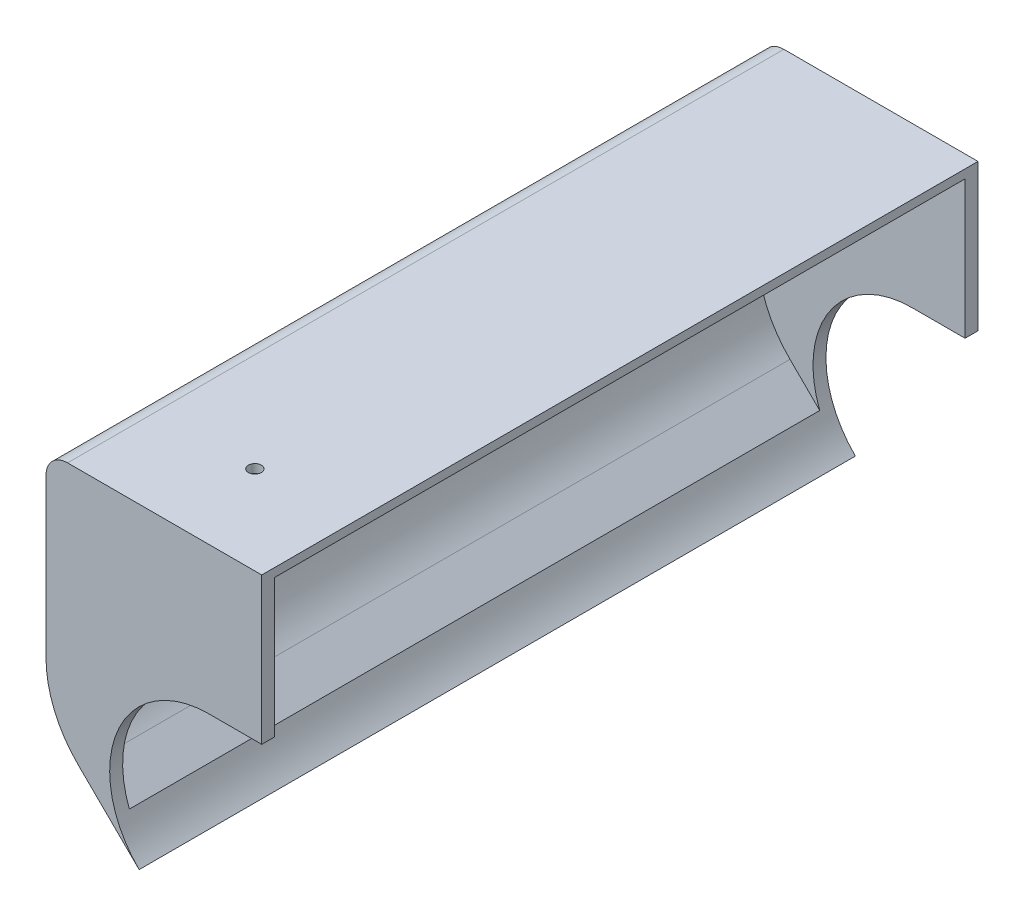
ISO-10303-21;
HEADER;
FILE_DESCRIPTION(('STEP AP214'),'2;1');
FILE_NAME('part.step','',(''),(''),'','','');
FILE_SCHEMA(('AUTOMOTIVE_DESIGN { 1 0 10303 214 1 1 1 1 }'));
ENDSEC;
DATA;
#1=APPLICATION_CONTEXT('core data for automotive mechanical design processes');
#2=APPLICATION_PROTOCOL_DEFINITION('international standard','automotive_design',2000,#1);
#3=PRODUCT_CONTEXT('',#1,'mechanical');
#4=PRODUCT('Part','Part','',(#3));
#5=PRODUCT_RELATED_PRODUCT_CATEGORY('part','',(#4));
#6=PRODUCT_DEFINITION_FORMATION('','',#4);
#7=PRODUCT_DEFINITION_CONTEXT('part definition',#1,'design');
#8=PRODUCT_DEFINITION('design','',#6,#7);
#9=PRODUCT_DEFINITION_SHAPE('','',#8);
#10=(LENGTH_UNIT() NAMED_UNIT(*) SI_UNIT(.MILLI.,.METRE.));
#11=(NAMED_UNIT(*) PLANE_ANGLE_UNIT() SI_UNIT($,.RADIAN.));
#12=(NAMED_UNIT(*) SI_UNIT($,.STERADIAN.) SOLID_ANGLE_UNIT());
#13=UNCERTAINTY_MEASURE_WITH_UNIT(LENGTH_MEASURE(1.E-05),#10,'distance_accuracy_value','');
#14=(GEOMETRIC_REPRESENTATION_CONTEXT(3) GLOBAL_UNCERTAINTY_ASSIGNED_CONTEXT((#13)) GLOBAL_UNIT_ASSIGNED_CONTEXT((#10,
#11,#12)) REPRESENTATION_CONTEXT('',''));
#15=CARTESIAN_POINT('',(0.,0.,0.));
#16=DIRECTION('',(0.,0.,1.));
#17=DIRECTION('',(1.,0.,0.));
#18=AXIS2_PLACEMENT_3D('',#15,#16,#17);
#19=CARTESIAN_POINT('',(-196.007283518404,25.8267663755461,-251.773732265294));
#20=DIRECTION('',(-1.,0.,0.));
#21=DIRECTION('',(0.,0.,1.));
#22=AXIS2_PLACEMENT_3D('',#19,#20,#21);
#23=PLANE('',#22);
#24=CARTESIAN_POINT('',(-196.007283518404,60.4000000000002,-20.5000000000001));
#25=DIRECTION('',(1.,0.,0.));
#26=DIRECTION('',(0.,0.,-1.));
#27=AXIS2_PLACEMENT_3D('',#24,#25,#26);
#28=CIRCLE('',#27,6.);
#29=CARTESIAN_POINT('',(-196.007283518404,60.4000000000002,-26.5000000000001));
#30=VERTEX_POINT('',#29);
#31=EDGE_CURVE('E487',#30,#30,#28,.T.);
#32=ORIENTED_EDGE('',*,*,#31,.F.);
#33=EDGE_LOOP('',(#32));
#34=FACE_BOUND('',#33,.T.);
#35=DIRECTION('',(0.,-1.,0.));
#36=VECTOR('',#35,1.);
#37=CARTESIAN_POINT('',(-196.007283518404,25.8267663755461,-3.));
#38=LINE('',#37,#36);
#39=CARTESIAN_POINT('',(-196.007283518404,70.,-3.));
#40=VERTEX_POINT('',#39);
#41=CARTESIAN_POINT('',(-196.007283518404,36.2637516572309,-3.));
#42=VERTEX_POINT('',#41);
#43=EDGE_CURVE('E243',#40,#42,#38,.T.);
#44=ORIENTED_EDGE('',*,*,#43,.T.);
#45=DIRECTION('',(0.,0.,1.));
#46=VECTOR('',#45,1.);
#47=CARTESIAN_POINT('',(-196.007283518404,36.2637516572309,-162.999999999996));
#48=LINE('',#47,#46);
#49=CARTESIAN_POINT('',(-196.007283518404,36.2637516572309,-162.999999999996));
#50=VERTEX_POINT('',#49);
#51=EDGE_CURVE('E319',#42,#50,#48,.F.);
#52=ORIENTED_EDGE('',*,*,#51,.T.);
#53=DIRECTION('',(0.,-1.,0.));
#54=VECTOR('',#53,1.);
#55=CARTESIAN_POINT('',(-196.007283518404,25.8267663755461,-162.999999999996));
#56=LINE('',#55,#54);
#57=CARTESIAN_POINT('',(-196.007283518404,70.,-162.999999999996));
#58=VERTEX_POINT('',#57);
#59=EDGE_CURVE('E252',#58,#50,#56,.T.);
#60=ORIENTED_EDGE('',*,*,#59,.F.);
#61=DIRECTION('',(0.,0.,1.));
#62=VECTOR('',#61,1.);
#63=CARTESIAN_POINT('',(-196.007283518404,70.,-3.));
#64=LINE('',#63,#62);
#65=EDGE_CURVE('E305',#58,#40,#64,.T.);
#66=ORIENTED_EDGE('',*,*,#65,.T.);
#67=EDGE_LOOP('',(#44,#52,#60,#66));
#68=FACE_BOUND('',#67,.T.);
#69=CARTESIAN_POINT('',(-196.007283518404,47.,-135.999999999996));
#70=DIRECTION('',(-1.,0.,0.));
#71=DIRECTION('',(0.,0.,1.));
#72=AXIS2_PLACEMENT_3D('',#69,#70,#71);
#73=CIRCLE('',#72,2.5);
#74=CARTESIAN_POINT('',(-196.007283518404,47.,-133.499999999996));
#75=VERTEX_POINT('',#74);
#76=EDGE_CURVE('E204',#75,#75,#73,.T.);
#77=ORIENTED_EDGE('',*,*,#76,.T.);
#78=EDGE_LOOP('',(#77));
#79=FACE_BOUND('',#78,.T.);
#80=CARTESIAN_POINT('',(-196.007283518404,47.,-30.));
#81=DIRECTION('',(-1.,0.,0.));
#82=DIRECTION('',(0.,0.,1.));
#83=AXIS2_PLACEMENT_3D('',#80,#81,#82);
#84=CIRCLE('',#83,2.5);
#85=CARTESIAN_POINT('',(-196.007283518404,47.,-27.5));
#86=VERTEX_POINT('',#85);
#87=EDGE_CURVE('E224',#86,#86,#84,.T.);
#88=ORIENTED_EDGE('',*,*,#87,.T.);
#89=EDGE_LOOP('',(#88));
#90=FACE_BOUND('',#89,.T.);
#91=DIRECTION('',(0.,1.,0.));
#92=VECTOR('',#91,1.);
#93=CARTESIAN_POINT('',(-196.007283518404,47.0000000000013,-105.499999999998));
#94=LINE('',#93,#92);
#95=CARTESIAN_POINT('',(-196.007283518404,47.0000000000013,-105.499999999998));
#96=VERTEX_POINT('',#95);
#97=CARTESIAN_POINT('',(-196.007283518404,67.0000000000014,-105.499999999998));
#98=VERTEX_POINT('',#97);
#99=EDGE_CURVE('E191',#96,#98,#94,.T.);
#100=ORIENTED_EDGE('',*,*,#99,.F.);
#101=DIRECTION('',(0.,0.,-1.));
#102=VECTOR('',#101,1.);
#103=CARTESIAN_POINT('',(-196.007283518404,47.0000000000009,-60.499999999998));
#104=LINE('',#103,#102);
#105=CARTESIAN_POINT('',(-196.007283518404,47.0000000000009,-60.499999999998));
#106=VERTEX_POINT('',#105);
#107=EDGE_CURVE('E188',#106,#96,#104,.T.);
#108=ORIENTED_EDGE('',*,*,#107,.F.);
#109=DIRECTION('',(0.,-1.,0.));
#110=VECTOR('',#109,1.);
#111=CARTESIAN_POINT('',(-196.007283518404,67.0000000000009,-60.4999999999978));
#112=LINE('',#111,#110);
#113=CARTESIAN_POINT('',(-196.007283518404,67.0000000000009,-60.4999999999978));
#114=VERTEX_POINT('',#113);
#115=EDGE_CURVE('E54',#114,#106,#112,.T.);
#116=ORIENTED_EDGE('',*,*,#115,.F.);
#117=DIRECTION('',(0.,0.,1.));
#118=VECTOR('',#117,1.);
#119=CARTESIAN_POINT('',(-196.007283518404,67.0000000000014,-105.499999999998));
#120=LINE('',#119,#118);
#121=EDGE_CURVE('E49',#98,#114,#120,.T.);
#122=ORIENTED_EDGE('',*,*,#121,.F.);
#123=EDGE_LOOP('',(#100,#108,#116,#122));
#124=FACE_BOUND('',#123,.T.);
#125=ADVANCED_FACE('F32',(#34,#68,#79,#90,#124),#23,.F.);
#126=CARTESIAN_POINT('',(-160.249999999999,20.,-3.));
#127=DIRECTION('',(0.,0.,1.));
#128=DIRECTION('',(1.,0.,0.));
#129=AXIS2_PLACEMENT_3D('',#126,#127,#128);
#130=PLANE('',#129);
#131=DIRECTION('',(0.711033468510001,-0.703158166175035,0.));
#132=VECTOR('',#131,1.);
#133=CARTESIAN_POINT('',(-181.686406662597,11.6645054498416,-3.));
#134=LINE('',#133,#132);
#135=CARTESIAN_POINT('',(-188.58623767278,18.4879149444809,-3.));
#136=VERTEX_POINT('',#135);
#137=CARTESIAN_POINT('',(-181.686406662598,11.6645054498418,-3.));
#138=VERTEX_POINT('',#137);
#139=EDGE_CURVE('E240',#136,#138,#134,.T.);
#140=ORIENTED_EDGE('',*,*,#139,.F.);
#141=CARTESIAN_POINT('',(-171.007283518404,36.2637516572309,-3.));
#142=DIRECTION('',(0.,0.,1.));
#143=DIRECTION('',(1.,0.,0.));
#144=AXIS2_PLACEMENT_3D('',#141,#142,#143);
#145=CIRCLE('',#144,25.);
#146=EDGE_CURVE('E317',#136,#42,#145,.F.);
#147=ORIENTED_EDGE('',*,*,#146,.T.);
#148=ORIENTED_EDGE('',*,*,#43,.F.);
#149=CARTESIAN_POINT('',(-191.007283518404,70.,-3.));
#150=DIRECTION('',(0.,0.,1.));
#151=DIRECTION('',(1.,0.,0.));
#152=AXIS2_PLACEMENT_3D('',#149,#150,#151);
#153=CIRCLE('',#152,5.);
#154=CARTESIAN_POINT('',(-191.007283518404,75.,-3.));
#155=VERTEX_POINT('',#154);
#156=EDGE_CURVE('E308',#40,#155,#153,.F.);
#157=ORIENTED_EDGE('',*,*,#156,.T.);
#158=DIRECTION('',(-1.,0.,0.));
#159=VECTOR('',#158,1.);
#160=CARTESIAN_POINT('',(-196.007283518404,75.,-3.));
#161=LINE('',#160,#159);
#162=CARTESIAN_POINT('',(-148.007283518404,75.,-3.));
#163=VERTEX_POINT('',#162);
#164=EDGE_CURVE('E246',#163,#155,#161,.T.);
#165=ORIENTED_EDGE('',*,*,#164,.F.);
#166=DIRECTION('',(0.,1.,0.));
#167=VECTOR('',#166,1.);
#168=CARTESIAN_POINT('',(-148.007283518404,43.,-3.));
#169=LINE('',#168,#167);
#170=CARTESIAN_POINT('',(-148.007283518404,43.,-3.));
#171=VERTEX_POINT('',#170);
#172=EDGE_CURVE('E268',#171,#163,#169,.T.);
#173=ORIENTED_EDGE('',*,*,#172,.F.);
#174=DIRECTION('',(1.,0.,0.));
#175=VECTOR('',#174,1.);
#176=CARTESIAN_POINT('',(-160.249999999999,43.,-3.));
#177=LINE('',#176,#175);
#178=CARTESIAN_POINT('',(-160.249999999999,43.,-3.));
#179=VERTEX_POINT('',#178);
#180=EDGE_CURVE('E264',#179,#171,#177,.T.);
#181=ORIENTED_EDGE('',*,*,#180,.F.);
#182=CARTESIAN_POINT('',(-160.249999999999,20.,-3.));
#183=DIRECTION('',(0.,0.,-1.));
#184=DIRECTION('',(1.,0.,0.));
#185=AXIS2_PLACEMENT_3D('',#182,#183,#184);
#186=CIRCLE('',#185,23.);
#187=EDGE_CURVE('E262',#138,#179,#186,.T.);
#188=ORIENTED_EDGE('',*,*,#187,.F.);
#189=EDGE_LOOP('',(#140,#147,#148,#157,#165,#173,#181,#188));
#190=FACE_BOUND('',#189,.T.);
#191=ADVANCED_FACE('F350',(#190),#130,.F.);
#192=CARTESIAN_POINT('',(-198.007283518404,24.9918075530113,-3.));
#193=DIRECTION('',(-1.,0.,0.));
#194=DIRECTION('',(0.,0.,1.));
#195=AXIS2_PLACEMENT_3D('',#192,#193,#194);
#196=PLANE('',#195);
#197=CARTESIAN_POINT('',(-198.007283518404,60.4000000000002,-20.5000000000001));
#198=DIRECTION('',(-1.,0.,0.));
#199=DIRECTION('',(0.,0.,1.));
#200=AXIS2_PLACEMENT_3D('',#197,#198,#199);
#201=CIRCLE('',#200,6.);
#202=CARTESIAN_POINT('',(-198.007283518404,60.4000000000002,-14.5000000000001));
#203=VERTEX_POINT('',#202);
#204=EDGE_CURVE('E482',#203,#203,#201,.F.);
#205=ORIENTED_EDGE('',*,*,#204,.T.);
#206=EDGE_LOOP('',(#205));
#207=FACE_BOUND('',#206,.T.);
#208=CARTESIAN_POINT('',(-198.007283518404,47.,-30.));
#209=DIRECTION('',(-1.,0.,0.));
#210=DIRECTION('',(0.,0.,1.));
#211=AXIS2_PLACEMENT_3D('',#208,#209,#210);
#212=CIRCLE('',#211,2.5);
#213=CARTESIAN_POINT('',(-198.007283518404,47.,-27.5));
#214=VERTEX_POINT('',#213);
#215=EDGE_CURVE('E201',#214,#214,#212,.T.);
#216=ORIENTED_EDGE('',*,*,#215,.F.);
#217=EDGE_LOOP('',(#216));
#218=FACE_BOUND('',#217,.T.);
#219=CARTESIAN_POINT('',(-198.007283518404,47.,-135.999999999996));
#220=DIRECTION('',(-1.,0.,0.));
#221=DIRECTION('',(0.,0.,-1.));
#222=AXIS2_PLACEMENT_3D('',#219,#220,#221);
#223=CIRCLE('',#222,2.5);
#224=CARTESIAN_POINT('',(-198.007283518404,47.,-138.499999999996));
#225=VERTEX_POINT('',#224);
#226=EDGE_CURVE('E205',#225,#225,#223,.T.);
#227=ORIENTED_EDGE('',*,*,#226,.F.);
#228=EDGE_LOOP('',(#227));
#229=FACE_BOUND('',#228,.T.);
#230=CARTESIAN_POINT('',(-198.007283518404,57.,-95.499999999998));
#231=DIRECTION('',(-1.,0.,0.));
#232=DIRECTION('',(0.,0.,1.));
#233=AXIS2_PLACEMENT_3D('',#230,#231,#232);
#234=CIRCLE('',#233,8.75);
#235=CARTESIAN_POINT('',(-198.007283518404,57.,-86.749999999998));
#236=VERTEX_POINT('',#235);
#237=EDGE_CURVE('E195',#236,#236,#234,.T.);
#238=ORIENTED_EDGE('',*,*,#237,.F.);
#239=EDGE_LOOP('',(#238));
#240=FACE_BOUND('',#239,.T.);
#241=CARTESIAN_POINT('',(-198.007283518404,57.,-70.499999999998));
#242=DIRECTION('',(-1.,0.,0.));
#243=DIRECTION('',(0.,0.,1.));
#244=AXIS2_PLACEMENT_3D('',#241,#242,#243);
#245=CIRCLE('',#244,8.75);
#246=CARTESIAN_POINT('',(-198.007283518404,57.,-61.749999999998));
#247=VERTEX_POINT('',#246);
#248=EDGE_CURVE('E192',#247,#247,#245,.T.);
#249=ORIENTED_EDGE('',*,*,#248,.F.);
#250=EDGE_LOOP('',(#249));
#251=FACE_BOUND('',#250,.T.);
#252=DIRECTION('',(0.,1.,0.));
#253=VECTOR('',#252,1.);
#254=CARTESIAN_POINT('',(-198.007283518404,24.9918075530113,-165.999999999996));
#255=LINE('',#254,#253);
#256=CARTESIAN_POINT('',(-198.007283518404,35.4287928346961,-165.999999999996));
#257=VERTEX_POINT('',#256);
#258=CARTESIAN_POINT('',(-198.007283518404,72.,-165.999999999996));
#259=VERTEX_POINT('',#258);
#260=EDGE_CURVE('E223',#257,#259,#255,.T.);
#261=ORIENTED_EDGE('',*,*,#260,.F.);
#262=DIRECTION('',(0.,0.,1.));
#263=VECTOR('',#262,1.);
#264=CARTESIAN_POINT('',(-198.007283518404,35.4287928346961,-3.));
#265=LINE('',#264,#263);
#266=CARTESIAN_POINT('',(-198.007283518404,35.4287928346961,0.));
#267=VERTEX_POINT('',#266);
#268=EDGE_CURVE('E323',#257,#267,#265,.T.);
#269=ORIENTED_EDGE('',*,*,#268,.T.);
#270=DIRECTION('',(0.,-1.,0.));
#271=VECTOR('',#270,1.);
#272=CARTESIAN_POINT('',(-198.007283518404,24.9918075530113,0.));
#273=LINE('',#272,#271);
#274=CARTESIAN_POINT('',(-198.007283518404,72.,0.));
#275=VERTEX_POINT('',#274);
#276=EDGE_CURVE('E251',#275,#267,#273,.T.);
#277=ORIENTED_EDGE('',*,*,#276,.F.);
#278=DIRECTION('',(0.,0.,1.));
#279=VECTOR('',#278,1.);
#280=CARTESIAN_POINT('',(-198.007283518404,72.,-3.));
#281=LINE('',#280,#279);
#282=EDGE_CURVE('E300',#275,#259,#281,.F.);
#283=ORIENTED_EDGE('',*,*,#282,.T.);
#284=EDGE_LOOP('',(#261,#269,#277,#283));
#285=FACE_BOUND('',#284,.T.);
#286=ADVANCED_FACE('F356',(#207,#218,#229,#240,#251,#285),#196,.T.);
#287=CARTESIAN_POINT('',(-198.007283518404,77.,-3.));
#288=DIRECTION('',(0.,1.,0.));
#289=DIRECTION('',(0.,0.,1.));
#290=AXIS2_PLACEMENT_3D('',#287,#288,#289);
#291=PLANE('',#290);
#292=CARTESIAN_POINT('',(-170.107283518404,77.,-20.5000000000002));
#293=DIRECTION('',(0.,1.,0.));
#294=DIRECTION('',(0.,0.,1.));
#295=AXIS2_PLACEMENT_3D('',#292,#293,#294);
#296=CIRCLE('',#295,1.5);
#297=CARTESIAN_POINT('',(-170.107283518404,77.,-19.0000000000002));
#298=VERTEX_POINT('',#297);
#299=EDGE_CURVE('E590',#298,#298,#296,.T.);
#300=ORIENTED_EDGE('',*,*,#299,.F.);
#301=EDGE_LOOP('',(#300));
#302=FACE_BOUND('',#301,.T.);
#303=DIRECTION('',(1.,0.,0.));
#304=VECTOR('',#303,1.);
#305=CARTESIAN_POINT('',(-198.007283518404,77.,-165.999999999996));
#306=LINE('',#305,#304);
#307=CARTESIAN_POINT('',(-193.007283518404,77.,-165.999999999996));
#308=VERTEX_POINT('',#307);
#309=CARTESIAN_POINT('',(-148.007283518404,77.,-165.999999999996));
#310=VERTEX_POINT('',#309);
#311=EDGE_CURVE('E226',#308,#310,#306,.T.);
#312=ORIENTED_EDGE('',*,*,#311,.F.);
#313=DIRECTION('',(0.,0.,1.));
#314=VECTOR('',#313,1.);
#315=CARTESIAN_POINT('',(-193.007283518404,77.,-3.));
#316=LINE('',#315,#314);
#317=CARTESIAN_POINT('',(-193.007283518404,77.,0.));
#318=VERTEX_POINT('',#317);
#319=EDGE_CURVE('E289',#308,#318,#316,.T.);
#320=ORIENTED_EDGE('',*,*,#319,.T.);
#321=DIRECTION('',(-1.,0.,0.));
#322=VECTOR('',#321,1.);
#323=CARTESIAN_POINT('',(-198.007283518404,77.,0.));
#324=LINE('',#323,#322);
#325=CARTESIAN_POINT('',(-148.007283518404,77.,0.));
#326=VERTEX_POINT('',#325);
#327=EDGE_CURVE('E265',#326,#318,#324,.T.);
#328=ORIENTED_EDGE('',*,*,#327,.F.);
#329=DIRECTION('',(0.,0.,1.));
#330=VECTOR('',#329,1.);
#331=CARTESIAN_POINT('',(-148.007283518404,77.,-3.));
#332=LINE('',#331,#330);
#333=EDGE_CURVE('E287',#310,#326,#332,.T.);
#334=ORIENTED_EDGE('',*,*,#333,.F.);
#335=EDGE_LOOP('',(#312,#320,#328,#334));
#336=FACE_BOUND('',#335,.T.);
#337=ADVANCED_FACE('F374',(#302,#336),#291,.T.);
#338=CARTESIAN_POINT('',(-148.007283518404,43.,-3.));
#339=DIRECTION('',(1.,0.,0.));
#340=DIRECTION('',(0.,0.,-1.));
#341=AXIS2_PLACEMENT_3D('',#338,#339,#340);
#342=PLANE('',#341);
#343=DIRECTION('',(0.,1.,0.));
#344=VECTOR('',#343,1.);
#345=CARTESIAN_POINT('',(-148.007283518404,43.,0.));
#346=LINE('',#345,#344);
#347=CARTESIAN_POINT('',(-148.007283518404,43.,0.));
#348=VERTEX_POINT('',#347);
#349=EDGE_CURVE('E282',#348,#326,#346,.T.);
#350=ORIENTED_EDGE('',*,*,#349,.F.);
#351=DIRECTION('',(0.,0.,1.));
#352=VECTOR('',#351,1.);
#353=CARTESIAN_POINT('',(-148.007283518404,43.,-3.));
#354=LINE('',#353,#352);
#355=EDGE_CURVE('E290',#171,#348,#354,.T.);
#356=ORIENTED_EDGE('',*,*,#355,.F.);
#357=ORIENTED_EDGE('',*,*,#172,.T.);
#358=DIRECTION('',(0.,0.,1.));
#359=VECTOR('',#358,1.);
#360=CARTESIAN_POINT('',(-148.007283518404,75.,-251.773732265294));
#361=LINE('',#360,#359);
#362=CARTESIAN_POINT('',(-148.007283518404,75.,-162.999999999996));
#363=VERTEX_POINT('',#362);
#364=EDGE_CURVE('E238',#363,#163,#361,.T.);
#365=ORIENTED_EDGE('',*,*,#364,.F.);
#366=DIRECTION('',(0.,-1.,0.));
#367=VECTOR('',#366,1.);
#368=CARTESIAN_POINT('',(-148.007283518404,77.,-162.999999999996));
#369=LINE('',#368,#367);
#370=CARTESIAN_POINT('',(-148.007283518404,43.,-162.999999999996));
#371=VERTEX_POINT('',#370);
#372=EDGE_CURVE('E210',#363,#371,#369,.T.);
#373=ORIENTED_EDGE('',*,*,#372,.T.);
#374=DIRECTION('',(0.,0.,-1.));
#375=VECTOR('',#374,1.);
#376=CARTESIAN_POINT('',(-148.007283518404,43.,-162.999999999996));
#377=LINE('',#376,#375);
#378=CARTESIAN_POINT('',(-148.007283518404,43.,-165.999999999996));
#379=VERTEX_POINT('',#378);
#380=EDGE_CURVE('E219',#371,#379,#377,.T.);
#381=ORIENTED_EDGE('',*,*,#380,.T.);
#382=DIRECTION('',(0.,-1.,0.));
#383=VECTOR('',#382,1.);
#384=CARTESIAN_POINT('',(-148.007283518404,77.,-165.999999999996));
#385=LINE('',#384,#383);
#386=EDGE_CURVE('E228',#310,#379,#385,.T.);
#387=ORIENTED_EDGE('',*,*,#386,.F.);
#388=ORIENTED_EDGE('',*,*,#333,.T.);
#389=EDGE_LOOP('',(#350,#356,#357,#365,#373,#381,#387,#388));
#390=FACE_BOUND('',#389,.T.);
#391=ADVANCED_FACE('F377',(#390),#342,.T.);
#392=CARTESIAN_POINT('',(-160.249999999999,43.,-3.));
#393=DIRECTION('',(0.,-1.,0.));
#394=DIRECTION('',(0.,0.,-1.));
#395=AXIS2_PLACEMENT_3D('',#392,#393,#394);
#396=PLANE('',#395);
#397=DIRECTION('',(1.,0.,0.));
#398=VECTOR('',#397,1.);
#399=CARTESIAN_POINT('',(-160.249999999999,43.,0.));
#400=LINE('',#399,#398);
#401=CARTESIAN_POINT('',(-160.249999999999,43.,0.));
#402=VERTEX_POINT('',#401);
#403=EDGE_CURVE('E279',#402,#348,#400,.T.);
#404=ORIENTED_EDGE('',*,*,#403,.F.);
#405=DIRECTION('',(0.,0.,1.));
#406=VECTOR('',#405,1.);
#407=CARTESIAN_POINT('',(-160.249999999999,43.,-3.));
#408=LINE('',#407,#406);
#409=EDGE_CURVE('E292',#179,#402,#408,.T.);
#410=ORIENTED_EDGE('',*,*,#409,.F.);
#411=ORIENTED_EDGE('',*,*,#180,.T.);
#412=ORIENTED_EDGE('',*,*,#355,.T.);
#413=EDGE_LOOP('',(#404,#410,#411,#412));
#414=FACE_BOUND('',#413,.T.);
#415=ADVANCED_FACE('F381',(#414),#396,.T.);
#416=CARTESIAN_POINT('',(-160.249999999999,20.,-3.));
#417=DIRECTION('',(0.,0.,1.));
#418=DIRECTION('',(1.,0.,0.));
#419=AXIS2_PLACEMENT_3D('',#416,#417,#418);
#420=CYLINDRICAL_SURFACE('',#419,23.);
#421=CARTESIAN_POINT('',(-160.249999999999,20.,0.));
#422=DIRECTION('',(0.,0.,-1.));
#423=DIRECTION('',(1.,0.,0.));
#424=AXIS2_PLACEMENT_3D('',#421,#422,#423);
#425=CIRCLE('',#424,23.);
#426=CARTESIAN_POINT('',(-176.422637822025,3.64623022426997,0.));
#427=VERTEX_POINT('',#426);
#428=EDGE_CURVE('E276',#427,#402,#425,.T.);
#429=ORIENTED_EDGE('',*,*,#428,.F.);
#430=DIRECTION('',(0.,0.,1.));
#431=VECTOR('',#430,1.);
#432=CARTESIAN_POINT('',(-176.422637822025,3.64623022426997,-3.));
#433=LINE('',#432,#431);
#434=CARTESIAN_POINT('',(-176.422637822025,3.64623022426997,-165.999999999996));
#435=VERTEX_POINT('',#434);
#436=EDGE_CURVE('E271',#435,#427,#433,.T.);
#437=ORIENTED_EDGE('',*,*,#436,.F.);
#438=CARTESIAN_POINT('',(-160.249999999999,20.,-165.999999999996));
#439=DIRECTION('',(0.,0.,1.));
#440=DIRECTION('',(-1.,0.,0.));
#441=AXIS2_PLACEMENT_3D('',#438,#439,#440);
#442=CIRCLE('',#441,23.);
#443=CARTESIAN_POINT('',(-160.249999999999,43.,-165.999999999996));
#444=VERTEX_POINT('',#443);
#445=EDGE_CURVE('E213',#444,#435,#442,.T.);
#446=ORIENTED_EDGE('',*,*,#445,.F.);
#447=DIRECTION('',(0.,0.,-1.));
#448=VECTOR('',#447,1.);
#449=CARTESIAN_POINT('',(-160.249999999999,43.,-162.999999999996));
#450=LINE('',#449,#448);
#451=CARTESIAN_POINT('',(-160.249999999999,43.,-162.999999999996));
#452=VERTEX_POINT('',#451);
#453=EDGE_CURVE('E236',#452,#444,#450,.T.);
#454=ORIENTED_EDGE('',*,*,#453,.F.);
#455=CARTESIAN_POINT('',(-160.249999999999,20.,-162.999999999996));
#456=DIRECTION('',(0.,0.,1.));
#457=DIRECTION('',(-1.,0.,0.));
#458=AXIS2_PLACEMENT_3D('',#455,#456,#457);
#459=CIRCLE('',#458,23.);
#460=CARTESIAN_POINT('',(-181.686406662598,11.6645054498418,-162.999999999996));
#461=VERTEX_POINT('',#460);
#462=EDGE_CURVE('E216',#452,#461,#459,.T.);
#463=ORIENTED_EDGE('',*,*,#462,.T.);
#464=DIRECTION('',(0.,0.,1.));
#465=VECTOR('',#464,1.);
#466=CARTESIAN_POINT('',(-181.686406662597,11.6645054498416,-251.773732265294));
#467=LINE('',#466,#465);
#468=EDGE_CURVE('E242',#461,#138,#467,.T.);
#469=ORIENTED_EDGE('',*,*,#468,.T.);
#470=ORIENTED_EDGE('',*,*,#187,.T.);
#471=ORIENTED_EDGE('',*,*,#409,.T.);
#472=EDGE_LOOP('',(#429,#437,#446,#454,#463,#469,#470,#471));
#473=FACE_BOUND('',#472,.T.);
#474=ADVANCED_FACE('F385',(#473),#420,.F.);
#475=CARTESIAN_POINT('',(-176.422637822025,3.64623022426997,-3.));
#476=DIRECTION('',(-0.703158166175034,-0.711033468510001,0.));
#477=DIRECTION('',(0.711033468510001,-0.703158166175034,0.));
#478=AXIS2_PLACEMENT_3D('',#475,#476,#477);
#479=PLANE('',#478);
#480=DIRECTION('',(0.711033468510001,-0.703158166175034,0.));
#481=VECTOR('',#480,1.);
#482=CARTESIAN_POINT('',(-176.422637822025,3.64623022426997,0.));
#483=LINE('',#482,#481);
#484=CARTESIAN_POINT('',(-190.58623767278,17.6529561219461,0.));
#485=VERTEX_POINT('',#484);
#486=EDGE_CURVE('E274',#485,#427,#483,.T.);
#487=ORIENTED_EDGE('',*,*,#486,.F.);
#488=DIRECTION('',(0.,0.,1.));
#489=VECTOR('',#488,1.);
#490=CARTESIAN_POINT('',(-190.58623767278,17.6529561219461,-3.));
#491=LINE('',#490,#489);
#492=CARTESIAN_POINT('',(-190.58623767278,17.6529561219461,-165.999999999996));
#493=VERTEX_POINT('',#492);
#494=EDGE_CURVE('E41',#485,#493,#491,.F.);
#495=ORIENTED_EDGE('',*,*,#494,.T.);
#496=DIRECTION('',(-0.711033468510001,0.703158166175035,0.));
#497=VECTOR('',#496,1.);
#498=CARTESIAN_POINT('',(-176.422637822025,3.64623022426997,-165.999999999996));
#499=LINE('',#498,#497);
#500=EDGE_CURVE('E220',#435,#493,#499,.T.);
#501=ORIENTED_EDGE('',*,*,#500,.F.);
#502=ORIENTED_EDGE('',*,*,#436,.T.);
#503=EDGE_LOOP('',(#487,#495,#501,#502));
#504=FACE_BOUND('',#503,.T.);
#505=ADVANCED_FACE('F372',(#504),#479,.T.);
#506=CARTESIAN_POINT('',(-160.249999999999,20.,0.));
#507=DIRECTION('',(0.,0.,1.));
#508=DIRECTION('',(1.,0.,0.));
#509=AXIS2_PLACEMENT_3D('',#506,#507,#508);
#510=PLANE('',#509);
#511=ORIENTED_EDGE('',*,*,#276,.T.);
#512=CARTESIAN_POINT('',(-173.007283518404,35.4287928346961,0.));
#513=DIRECTION('',(0.,0.,1.));
#514=DIRECTION('',(1.,0.,0.));
#515=AXIS2_PLACEMENT_3D('',#512,#513,#514);
#516=CIRCLE('',#515,25.);
#517=EDGE_CURVE('E326',#267,#485,#516,.T.);
#518=ORIENTED_EDGE('',*,*,#517,.T.);
#519=ORIENTED_EDGE('',*,*,#486,.T.);
#520=ORIENTED_EDGE('',*,*,#428,.T.);
#521=ORIENTED_EDGE('',*,*,#403,.T.);
#522=ORIENTED_EDGE('',*,*,#349,.T.);
#523=ORIENTED_EDGE('',*,*,#327,.T.);
#524=CARTESIAN_POINT('',(-193.007283518404,72.,0.));
#525=DIRECTION('',(0.,0.,1.));
#526=DIRECTION('',(1.,0.,0.));
#527=AXIS2_PLACEMENT_3D('',#524,#525,#526);
#528=CIRCLE('',#527,5.);
#529=EDGE_CURVE('E298',#318,#275,#528,.T.);
#530=ORIENTED_EDGE('',*,*,#529,.T.);
#531=EDGE_LOOP('',(#511,#518,#519,#520,#521,#522,#523,#530));
#532=FACE_BOUND('',#531,.T.);
#533=ADVANCED_FACE('F367',(#532),#510,.T.);
#534=CARTESIAN_POINT('',(-196.007283518404,75.,-251.773732265294));
#535=DIRECTION('',(0.,1.,0.));
#536=DIRECTION('',(0.,0.,1.));
#537=AXIS2_PLACEMENT_3D('',#534,#535,#536);
#538=PLANE('',#537);
#539=CARTESIAN_POINT('',(-170.107283518404,75.,-20.5000000000002));
#540=DIRECTION('',(0.,1.,0.));
#541=DIRECTION('',(0.,0.,1.));
#542=AXIS2_PLACEMENT_3D('',#539,#540,#541);
#543=CIRCLE('',#542,1.5);
#544=CARTESIAN_POINT('',(-170.107283518404,75.,-19.0000000000002));
#545=VERTEX_POINT('',#544);
#546=EDGE_CURVE('E36',#545,#545,#543,.T.);
#547=ORIENTED_EDGE('',*,*,#546,.T.);
#548=EDGE_LOOP('',(#547));
#549=FACE_BOUND('',#548,.T.);
#550=ORIENTED_EDGE('',*,*,#164,.T.);
#551=DIRECTION('',(0.,0.,1.));
#552=VECTOR('',#551,1.);
#553=CARTESIAN_POINT('',(-191.007283518404,75.,-162.999999999996));
#554=LINE('',#553,#552);
#555=CARTESIAN_POINT('',(-191.007283518404,75.,-162.999999999996));
#556=VERTEX_POINT('',#555);
#557=EDGE_CURVE('E310',#155,#556,#554,.F.);
#558=ORIENTED_EDGE('',*,*,#557,.T.);
#559=DIRECTION('',(-1.,0.,0.));
#560=VECTOR('',#559,1.);
#561=CARTESIAN_POINT('',(-196.007283518404,75.,-162.999999999996));
#562=LINE('',#561,#560);
#563=EDGE_CURVE('E255',#363,#556,#562,.T.);
#564=ORIENTED_EDGE('',*,*,#563,.F.);
#565=ORIENTED_EDGE('',*,*,#364,.T.);
#566=EDGE_LOOP('',(#550,#558,#564,#565));
#567=FACE_BOUND('',#566,.T.);
#568=ADVANCED_FACE('F365',(#549,#567),#538,.F.);
#569=CARTESIAN_POINT('',(-181.686406662597,11.6645054498416,-251.773732265294));
#570=DIRECTION('',(-0.703158166175035,-0.711033468510001,0.));
#571=DIRECTION('',(0.711033468510001,-0.703158166175035,0.));
#572=AXIS2_PLACEMENT_3D('',#569,#570,#571);
#573=PLANE('',#572);
#574=DIRECTION('',(0.711033468510001,-0.703158166175035,0.));
#575=VECTOR('',#574,1.);
#576=CARTESIAN_POINT('',(-181.686406662597,11.6645054498416,-162.999999999996));
#577=LINE('',#576,#575);
#578=CARTESIAN_POINT('',(-188.58623767278,18.4879149444809,-162.999999999996));
#579=VERTEX_POINT('',#578);
#580=EDGE_CURVE('E249',#579,#461,#577,.T.);
#581=ORIENTED_EDGE('',*,*,#580,.F.);
#582=DIRECTION('',(0.,0.,1.));
#583=VECTOR('',#582,1.);
#584=CARTESIAN_POINT('',(-188.58623767278,18.4879149444809,-3.));
#585=LINE('',#584,#583);
#586=EDGE_CURVE('E314',#579,#136,#585,.T.);
#587=ORIENTED_EDGE('',*,*,#586,.T.);
#588=ORIENTED_EDGE('',*,*,#139,.T.);
#589=ORIENTED_EDGE('',*,*,#468,.F.);
#590=EDGE_LOOP('',(#581,#587,#588,#589));
#591=FACE_BOUND('',#590,.T.);
#592=ADVANCED_FACE('F363',(#591),#573,.F.);
#593=CARTESIAN_POINT('',(-160.249999999999,20.,-162.999999999996));
#594=DIRECTION('',(0.,0.,-1.));
#595=DIRECTION('',(-1.,0.,0.));
#596=AXIS2_PLACEMENT_3D('',#593,#594,#595);
#597=PLANE('',#596);
#598=ORIENTED_EDGE('',*,*,#59,.T.);
#599=CARTESIAN_POINT('',(-171.007283518404,36.2637516572309,-162.999999999996));
#600=DIRECTION('',(0.,0.,-1.));
#601=DIRECTION('',(-1.,0.,0.));
#602=AXIS2_PLACEMENT_3D('',#599,#600,#601);
#603=CIRCLE('',#602,25.);
#604=EDGE_CURVE('E321',#50,#579,#603,.F.);
#605=ORIENTED_EDGE('',*,*,#604,.T.);
#606=ORIENTED_EDGE('',*,*,#580,.T.);
#607=ORIENTED_EDGE('',*,*,#462,.F.);
#608=DIRECTION('',(-1.,0.,0.));
#609=VECTOR('',#608,1.);
#610=CARTESIAN_POINT('',(-148.007283518404,43.,-162.999999999996));
#611=LINE('',#610,#609);
#612=EDGE_CURVE('E212',#371,#452,#611,.T.);
#613=ORIENTED_EDGE('',*,*,#612,.F.);
#614=ORIENTED_EDGE('',*,*,#372,.F.);
#615=ORIENTED_EDGE('',*,*,#563,.T.);
#616=CARTESIAN_POINT('',(-191.007283518404,70.,-162.999999999996));
#617=DIRECTION('',(0.,0.,-1.));
#618=DIRECTION('',(-1.,0.,0.));
#619=AXIS2_PLACEMENT_3D('',#616,#617,#618);
#620=CIRCLE('',#619,5.);
#621=EDGE_CURVE('E312',#556,#58,#620,.F.);
#622=ORIENTED_EDGE('',*,*,#621,.T.);
#623=EDGE_LOOP('',(#598,#605,#606,#607,#613,#614,#615,#622));
#624=FACE_BOUND('',#623,.T.);
#625=ADVANCED_FACE('F417',(#624),#597,.F.);
#626=CARTESIAN_POINT('',(-148.007283518404,43.,-162.999999999996));
#627=DIRECTION('',(0.,-1.,0.));
#628=DIRECTION('',(1.,0.,0.));
#629=AXIS2_PLACEMENT_3D('',#626,#627,#628);
#630=PLANE('',#629);
#631=DIRECTION('',(-1.,0.,0.));
#632=VECTOR('',#631,1.);
#633=CARTESIAN_POINT('',(-148.007283518404,43.,-165.999999999996));
#634=LINE('',#633,#632);
#635=EDGE_CURVE('E231',#379,#444,#634,.T.);
#636=ORIENTED_EDGE('',*,*,#635,.F.);
#637=ORIENTED_EDGE('',*,*,#380,.F.);
#638=ORIENTED_EDGE('',*,*,#612,.T.);
#639=ORIENTED_EDGE('',*,*,#453,.T.);
#640=EDGE_LOOP('',(#636,#637,#638,#639));
#641=FACE_BOUND('',#640,.T.);
#642=ADVANCED_FACE('F431',(#641),#630,.T.);
#643=CARTESIAN_POINT('',(-160.249999999999,20.,-165.999999999996));
#644=DIRECTION('',(0.,0.,-1.));
#645=DIRECTION('',(-1.,0.,0.));
#646=AXIS2_PLACEMENT_3D('',#643,#644,#645);
#647=PLANE('',#646);
#648=ORIENTED_EDGE('',*,*,#500,.T.);
#649=CARTESIAN_POINT('',(-173.007283518404,35.4287928346961,-165.999999999996));
#650=DIRECTION('',(0.,0.,-1.));
#651=DIRECTION('',(-1.,0.,0.));
#652=AXIS2_PLACEMENT_3D('',#649,#650,#651);
#653=CIRCLE('',#652,25.);
#654=EDGE_CURVE('E11',#493,#257,#653,.T.);
#655=ORIENTED_EDGE('',*,*,#654,.T.);
#656=ORIENTED_EDGE('',*,*,#260,.T.);
#657=CARTESIAN_POINT('',(-193.007283518404,72.,-165.999999999996));
#658=DIRECTION('',(0.,0.,-1.));
#659=DIRECTION('',(-1.,0.,0.));
#660=AXIS2_PLACEMENT_3D('',#657,#658,#659);
#661=CIRCLE('',#660,5.);
#662=EDGE_CURVE('E303',#259,#308,#661,.T.);
#663=ORIENTED_EDGE('',*,*,#662,.T.);
#664=ORIENTED_EDGE('',*,*,#311,.T.);
#665=ORIENTED_EDGE('',*,*,#386,.T.);
#666=ORIENTED_EDGE('',*,*,#635,.T.);
#667=ORIENTED_EDGE('',*,*,#445,.T.);
#668=EDGE_LOOP('',(#648,#655,#656,#663,#664,#665,#666,#667));
#669=FACE_BOUND('',#668,.T.);
#670=ADVANCED_FACE('F400',(#669),#647,.T.);
#671=CARTESIAN_POINT('',(-193.007283518404,72.,-3.));
#672=DIRECTION('',(0.,0.,1.));
#673=DIRECTION('',(1.,0.,0.));
#674=AXIS2_PLACEMENT_3D('',#671,#672,#673);
#675=CYLINDRICAL_SURFACE('',#674,5.);
#676=ORIENTED_EDGE('',*,*,#662,.F.);
#677=ORIENTED_EDGE('',*,*,#282,.F.);
#678=ORIENTED_EDGE('',*,*,#529,.F.);
#679=ORIENTED_EDGE('',*,*,#319,.F.);
#680=EDGE_LOOP('',(#676,#677,#678,#679));
#681=FACE_BOUND('',#680,.T.);
#682=ADVANCED_FACE('F396',(#681),#675,.T.);
#683=CARTESIAN_POINT('',(-191.007283518404,70.,-251.773732265294));
#684=DIRECTION('',(0.,0.,-1.));
#685=DIRECTION('',(-1.,0.,0.));
#686=AXIS2_PLACEMENT_3D('',#683,#684,#685);
#687=CYLINDRICAL_SURFACE('',#686,5.);
#688=ORIENTED_EDGE('',*,*,#621,.F.);
#689=ORIENTED_EDGE('',*,*,#557,.F.);
#690=ORIENTED_EDGE('',*,*,#156,.F.);
#691=ORIENTED_EDGE('',*,*,#65,.F.);
#692=EDGE_LOOP('',(#688,#689,#690,#691));
#693=FACE_BOUND('',#692,.T.);
#694=ADVANCED_FACE('F399',(#693),#687,.F.);
#695=CARTESIAN_POINT('',(-171.007283518404,36.2637516572309,-251.773732265294));
#696=DIRECTION('',(0.,0.,-1.));
#697=DIRECTION('',(-1.,0.,0.));
#698=AXIS2_PLACEMENT_3D('',#695,#696,#697);
#699=CYLINDRICAL_SURFACE('',#698,25.);
#700=ORIENTED_EDGE('',*,*,#604,.F.);
#701=ORIENTED_EDGE('',*,*,#51,.F.);
#702=ORIENTED_EDGE('',*,*,#146,.F.);
#703=ORIENTED_EDGE('',*,*,#586,.F.);
#704=EDGE_LOOP('',(#700,#701,#702,#703));
#705=FACE_BOUND('',#704,.T.);
#706=ADVANCED_FACE('F403',(#705),#699,.F.);
#707=CARTESIAN_POINT('',(-173.007283518404,35.4287928346961,-3.));
#708=DIRECTION('',(0.,0.,1.));
#709=DIRECTION('',(1.,0.,0.));
#710=AXIS2_PLACEMENT_3D('',#707,#708,#709);
#711=CYLINDRICAL_SURFACE('',#710,25.);
#712=ORIENTED_EDGE('',*,*,#654,.F.);
#713=ORIENTED_EDGE('',*,*,#494,.F.);
#714=ORIENTED_EDGE('',*,*,#517,.F.);
#715=ORIENTED_EDGE('',*,*,#268,.F.);
#716=EDGE_LOOP('',(#712,#713,#714,#715));
#717=FACE_BOUND('',#716,.T.);
#718=ADVANCED_FACE('F34',(#717),#711,.T.);
#719=CARTESIAN_POINT('',(-191.007283518404,57.,-70.499999999998));
#720=DIRECTION('',(-1.,0.,0.));
#721=DIRECTION('',(0.,0.,1.));
#722=AXIS2_PLACEMENT_3D('',#719,#720,#721);
#723=CYLINDRICAL_SURFACE('',#722,8.75);
#724=ORIENTED_EDGE('',*,*,#248,.T.);
#725=EDGE_LOOP('',(#724));
#726=FACE_BOUND('',#725,.T.);
#727=CARTESIAN_POINT('',(-188.007283518404,57.,-70.499999999998));
#728=DIRECTION('',(1.,0.,0.));
#729=DIRECTION('',(0.,0.,-1.));
#730=AXIS2_PLACEMENT_3D('',#727,#728,#729);
#731=CIRCLE('',#730,8.75);
#732=CARTESIAN_POINT('',(-188.007283518404,57.,-79.249999999998));
#733=VERTEX_POINT('',#732);
#734=EDGE_CURVE('E481',#733,#733,#731,.T.);
#735=ORIENTED_EDGE('',*,*,#734,.T.);
#736=EDGE_LOOP('',(#735));
#737=FACE_BOUND('',#736,.T.);
#738=ADVANCED_FACE('F410',(#726,#737),#723,.F.);
#739=CARTESIAN_POINT('',(-191.007283518404,57.,-95.499999999998));
#740=DIRECTION('',(-1.,0.,0.));
#741=DIRECTION('',(0.,0.,1.));
#742=AXIS2_PLACEMENT_3D('',#739,#740,#741);
#743=CYLINDRICAL_SURFACE('',#742,8.75);
#744=ORIENTED_EDGE('',*,*,#237,.T.);
#745=EDGE_LOOP('',(#744));
#746=FACE_BOUND('',#745,.T.);
#747=CARTESIAN_POINT('',(-188.007283518404,57.,-95.499999999998));
#748=DIRECTION('',(1.,0.,0.));
#749=DIRECTION('',(0.,0.,-1.));
#750=AXIS2_PLACEMENT_3D('',#747,#748,#749);
#751=CIRCLE('',#750,8.75);
#752=CARTESIAN_POINT('',(-188.007283518404,57.,-104.249999999998));
#753=VERTEX_POINT('',#752);
#754=EDGE_CURVE('E480',#753,#753,#751,.T.);
#755=ORIENTED_EDGE('',*,*,#754,.T.);
#756=EDGE_LOOP('',(#755));
#757=FACE_BOUND('',#756,.T.);
#758=ADVANCED_FACE('F345',(#746,#757),#743,.F.);
#759=CARTESIAN_POINT('',(-191.007283518404,47.,-135.999999999996));
#760=DIRECTION('',(-1.,0.,0.));
#761=DIRECTION('',(0.,0.,1.));
#762=AXIS2_PLACEMENT_3D('',#759,#760,#761);
#763=CYLINDRICAL_SURFACE('',#762,2.5);
#764=ORIENTED_EDGE('',*,*,#226,.T.);
#765=EDGE_LOOP('',(#764));
#766=FACE_BOUND('',#765,.T.);
#767=ORIENTED_EDGE('',*,*,#76,.F.);
#768=EDGE_LOOP('',(#767));
#769=FACE_BOUND('',#768,.T.);
#770=ADVANCED_FACE('F336',(#766,#769),#763,.F.);
#771=CARTESIAN_POINT('',(-191.007283518404,47.,-30.));
#772=DIRECTION('',(-1.,0.,0.));
#773=DIRECTION('',(0.,0.,1.));
#774=AXIS2_PLACEMENT_3D('',#771,#772,#773);
#775=CYLINDRICAL_SURFACE('',#774,2.5);
#776=ORIENTED_EDGE('',*,*,#215,.T.);
#777=EDGE_LOOP('',(#776));
#778=FACE_BOUND('',#777,.T.);
#779=ORIENTED_EDGE('',*,*,#87,.F.);
#780=EDGE_LOOP('',(#779));
#781=FACE_BOUND('',#780,.T.);
#782=ADVANCED_FACE('F334',(#778,#781),#775,.F.);
#783=CARTESIAN_POINT('',(-188.007283518404,0.,0.));
#784=DIRECTION('',(1.,0.,0.));
#785=DIRECTION('',(0.,0.,-1.));
#786=AXIS2_PLACEMENT_3D('',#783,#784,#785);
#787=PLANE('',#786);
#788=ORIENTED_EDGE('',*,*,#734,.F.);
#789=EDGE_LOOP('',(#788));
#790=FACE_BOUND('',#789,.T.);
#791=DIRECTION('',(0.,1.,0.));
#792=VECTOR('',#791,1.);
#793=CARTESIAN_POINT('',(-188.007283518404,47.0000000000013,-105.499999999998));
#794=LINE('',#793,#792);
#795=CARTESIAN_POINT('',(-188.007283518404,47.0000000000013,-105.499999999998));
#796=VERTEX_POINT('',#795);
#797=CARTESIAN_POINT('',(-188.007283518404,67.0000000000014,-105.499999999998));
#798=VERTEX_POINT('',#797);
#799=EDGE_CURVE('E178',#796,#798,#794,.T.);
#800=ORIENTED_EDGE('',*,*,#799,.T.);
#801=DIRECTION('',(0.,0.,1.));
#802=VECTOR('',#801,1.);
#803=CARTESIAN_POINT('',(-188.007283518404,67.0000000000014,-105.499999999998));
#804=LINE('',#803,#802);
#805=CARTESIAN_POINT('',(-188.007283518404,67.0000000000009,-60.4999999999978));
#806=VERTEX_POINT('',#805);
#807=EDGE_CURVE('E167',#798,#806,#804,.T.);
#808=ORIENTED_EDGE('',*,*,#807,.T.);
#809=DIRECTION('',(0.,-1.,0.));
#810=VECTOR('',#809,1.);
#811=CARTESIAN_POINT('',(-188.007283518404,67.0000000000009,-60.4999999999978));
#812=LINE('',#811,#810);
#813=CARTESIAN_POINT('',(-188.007283518404,47.0000000000009,-60.499999999998));
#814=VERTEX_POINT('',#813);
#815=EDGE_CURVE('E177',#806,#814,#812,.T.);
#816=ORIENTED_EDGE('',*,*,#815,.T.);
#817=DIRECTION('',(0.,0.,-1.));
#818=VECTOR('',#817,1.);
#819=CARTESIAN_POINT('',(-188.007283518404,47.0000000000009,-60.499999999998));
#820=LINE('',#819,#818);
#821=EDGE_CURVE('E184',#814,#796,#820,.T.);
#822=ORIENTED_EDGE('',*,*,#821,.T.);
#823=EDGE_LOOP('',(#800,#808,#816,#822));
#824=FACE_BOUND('',#823,.T.);
#825=ORIENTED_EDGE('',*,*,#754,.F.);
#826=EDGE_LOOP('',(#825));
#827=FACE_BOUND('',#826,.T.);
#828=ADVANCED_FACE('F181',(#790,#824,#827),#787,.T.);
#829=CARTESIAN_POINT('',(-188.007283518404,47.0000000000013,-105.499999999998));
#830=DIRECTION('',(0.,0.,1.));
#831=DIRECTION('',(0.,-1.,0.));
#832=AXIS2_PLACEMENT_3D('',#829,#830,#831);
#833=PLANE('',#832);
#834=ORIENTED_EDGE('',*,*,#99,.T.);
#835=DIRECTION('',(-1.,0.,0.));
#836=VECTOR('',#835,1.);
#837=CARTESIAN_POINT('',(-188.007283518404,67.0000000000014,-105.499999999998));
#838=LINE('',#837,#836);
#839=EDGE_CURVE('E171',#798,#98,#838,.T.);
#840=ORIENTED_EDGE('',*,*,#839,.F.);
#841=ORIENTED_EDGE('',*,*,#799,.F.);
#842=DIRECTION('',(-1.,0.,0.));
#843=VECTOR('',#842,1.);
#844=CARTESIAN_POINT('',(-188.007283518404,47.0000000000013,-105.499999999998));
#845=LINE('',#844,#843);
#846=EDGE_CURVE('E493',#796,#96,#845,.T.);
#847=ORIENTED_EDGE('',*,*,#846,.T.);
#848=EDGE_LOOP('',(#834,#840,#841,#847));
#849=FACE_BOUND('',#848,.T.);
#850=ADVANCED_FACE('F190',(#849),#833,.F.);
#851=CARTESIAN_POINT('',(-188.007283518404,67.0000000000014,-105.499999999998));
#852=DIRECTION('',(0.,-1.,0.));
#853=DIRECTION('',(0.,0.,-1.));
#854=AXIS2_PLACEMENT_3D('',#851,#852,#853);
#855=PLANE('',#854);
#856=ORIENTED_EDGE('',*,*,#121,.T.);
#857=DIRECTION('',(-1.,0.,0.));
#858=VECTOR('',#857,1.);
#859=CARTESIAN_POINT('',(-188.007283518404,67.0000000000009,-60.4999999999978));
#860=LINE('',#859,#858);
#861=EDGE_CURVE('E174',#806,#114,#860,.T.);
#862=ORIENTED_EDGE('',*,*,#861,.F.);
#863=ORIENTED_EDGE('',*,*,#807,.F.);
#864=ORIENTED_EDGE('',*,*,#839,.T.);
#865=EDGE_LOOP('',(#856,#862,#863,#864));
#866=FACE_BOUND('',#865,.T.);
#867=ADVANCED_FACE('F169',(#866),#855,.F.);
#868=CARTESIAN_POINT('',(-188.007283518404,67.0000000000009,-60.4999999999978));
#869=DIRECTION('',(0.,0.,-1.));
#870=DIRECTION('',(0.,1.,0.));
#871=AXIS2_PLACEMENT_3D('',#868,#869,#870);
#872=PLANE('',#871);
#873=ORIENTED_EDGE('',*,*,#115,.T.);
#874=DIRECTION('',(-1.,0.,0.));
#875=VECTOR('',#874,1.);
#876=CARTESIAN_POINT('',(-188.007283518404,47.0000000000009,-60.499999999998));
#877=LINE('',#876,#875);
#878=EDGE_CURVE('E197',#814,#106,#877,.T.);
#879=ORIENTED_EDGE('',*,*,#878,.F.);
#880=ORIENTED_EDGE('',*,*,#815,.F.);
#881=ORIENTED_EDGE('',*,*,#861,.T.);
#882=EDGE_LOOP('',(#873,#879,#880,#881));
#883=FACE_BOUND('',#882,.T.);
#884=ADVANCED_FACE('F504',(#883),#872,.F.);
#885=CARTESIAN_POINT('',(-188.007283518404,47.0000000000009,-60.499999999998));
#886=DIRECTION('',(0.,1.,0.));
#887=DIRECTION('',(0.,0.,1.));
#888=AXIS2_PLACEMENT_3D('',#885,#886,#887);
#889=PLANE('',#888);
#890=ORIENTED_EDGE('',*,*,#107,.T.);
#891=ORIENTED_EDGE('',*,*,#846,.F.);
#892=ORIENTED_EDGE('',*,*,#821,.F.);
#893=ORIENTED_EDGE('',*,*,#878,.T.);
#894=EDGE_LOOP('',(#890,#891,#892,#893));
#895=FACE_BOUND('',#894,.T.);
#896=ADVANCED_FACE('F502',(#895),#889,.F.);
#897=CARTESIAN_POINT('',(-214.977846266881,60.4000000000002,-20.5000000000001));
#898=DIRECTION('',(1.,0.,0.));
#899=DIRECTION('',(0.,0.,-1.));
#900=AXIS2_PLACEMENT_3D('',#897,#898,#899);
#901=CYLINDRICAL_SURFACE('',#900,6.);
#902=ORIENTED_EDGE('',*,*,#31,.T.);
#903=EDGE_LOOP('',(#902));
#904=FACE_BOUND('',#903,.T.);
#905=ORIENTED_EDGE('',*,*,#204,.F.);
#906=EDGE_LOOP('',(#905));
#907=FACE_BOUND('',#906,.T.);
#908=ADVANCED_FACE('F511',(#904,#907),#901,.F.);
#909=CARTESIAN_POINT('',(-170.107283518404,74.,-20.5000000000002));
#910=DIRECTION('',(0.,1.,0.));
#911=DIRECTION('',(0.,0.,1.));
#912=AXIS2_PLACEMENT_3D('',#909,#910,#911);
#913=CYLINDRICAL_SURFACE('',#912,1.5);
#914=ORIENTED_EDGE('',*,*,#299,.T.);
#915=EDGE_LOOP('',(#914));
#916=FACE_BOUND('',#915,.T.);
#917=ORIENTED_EDGE('',*,*,#546,.F.);
#918=EDGE_LOOP('',(#917));
#919=FACE_BOUND('',#918,.T.);
#920=ADVANCED_FACE('F557',(#916,#919),#913,.F.);
#921=CLOSED_SHELL('',(#125,#191,#286,#337,#391,#415,#474,#505,#533,#568,#592,#625,#642,#670,
#682,#694,#706,#718,#738,#758,#770,#782,#828,#850,#867,#884,#896,#908,#920));
#922=MANIFOLD_SOLID_BREP('B2',#921);
#923=ADVANCED_BREP_SHAPE_REPRESENTATION('',(#18,#922),#14);
#924=SHAPE_DEFINITION_REPRESENTATION(#9,#923);
ENDSEC;
END-ISO-10303-21;
